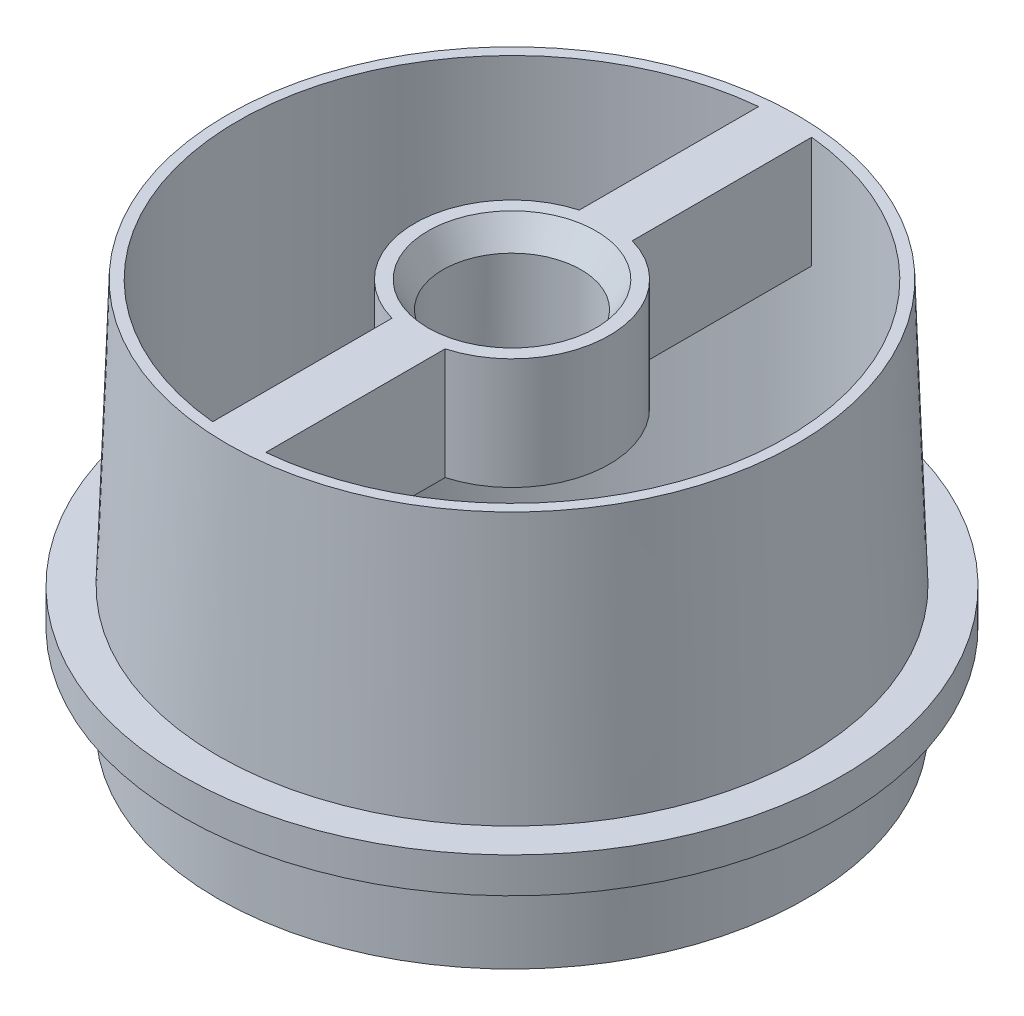
ISO-10303-21;
HEADER;
FILE_DESCRIPTION(('STEP AP214'),'2;1');
FILE_NAME('part.step','',(''),(''),'','','');
FILE_SCHEMA(('AUTOMOTIVE_DESIGN { 1 0 10303 214 1 1 1 1 }'));
ENDSEC;
DATA;
#1=APPLICATION_CONTEXT('core data for automotive mechanical design processes');
#2=APPLICATION_PROTOCOL_DEFINITION('international standard','automotive_design',2000,#1);
#3=PRODUCT_CONTEXT('',#1,'mechanical');
#4=PRODUCT('Part','Part','',(#3));
#5=PRODUCT_RELATED_PRODUCT_CATEGORY('part','',(#4));
#6=PRODUCT_DEFINITION_FORMATION('','',#4);
#7=PRODUCT_DEFINITION_CONTEXT('part definition',#1,'design');
#8=PRODUCT_DEFINITION('design','',#6,#7);
#9=PRODUCT_DEFINITION_SHAPE('','',#8);
#10=(LENGTH_UNIT() NAMED_UNIT(*) SI_UNIT(.MILLI.,.METRE.));
#11=(NAMED_UNIT(*) PLANE_ANGLE_UNIT() SI_UNIT($,.RADIAN.));
#12=(NAMED_UNIT(*) SI_UNIT($,.STERADIAN.) SOLID_ANGLE_UNIT());
#13=UNCERTAINTY_MEASURE_WITH_UNIT(LENGTH_MEASURE(1.E-05),#10,'distance_accuracy_value','');
#14=(GEOMETRIC_REPRESENTATION_CONTEXT(3) GLOBAL_UNCERTAINTY_ASSIGNED_CONTEXT((#13)) GLOBAL_UNIT_ASSIGNED_CONTEXT((#10,
#11,#12)) REPRESENTATION_CONTEXT('',''));
#15=CARTESIAN_POINT('',(0.,0.,0.));
#16=DIRECTION('',(0.,0.,1.));
#17=DIRECTION('',(1.,0.,0.));
#18=AXIS2_PLACEMENT_3D('',#15,#16,#17);
#19=CARTESIAN_POINT('',(0.,-2.,0.));
#20=DIRECTION('',(0.,1.,0.));
#21=DIRECTION('',(0.,0.,1.));
#22=AXIS2_PLACEMENT_3D('',#19,#20,#21);
#23=PLANE('',#22);
#24=CARTESIAN_POINT('',(0.,-2.,0.));
#25=DIRECTION('',(0.,1.,0.));
#26=DIRECTION('',(0.,0.,1.));
#27=AXIS2_PLACEMENT_3D('',#24,#25,#26);
#28=CIRCLE('',#27,18.625);
#29=CARTESIAN_POINT('',(0.,-2.,18.625));
#30=VERTEX_POINT('',#29);
#31=EDGE_CURVE('E178',#30,#30,#28,.T.);
#32=ORIENTED_EDGE('',*,*,#31,.F.);
#33=EDGE_LOOP('',(#32));
#34=FACE_BOUND('',#33,.T.);
#35=CARTESIAN_POINT('',(0.,-2.,0.));
#36=DIRECTION('',(0.,1.,0.));
#37=DIRECTION('',(0.,0.,1.));
#38=AXIS2_PLACEMENT_3D('',#35,#36,#37);
#39=CIRCLE('',#38,16.625);
#40=CARTESIAN_POINT('',(0.,-2.,16.625));
#41=VERTEX_POINT('',#40);
#42=EDGE_CURVE('E11',#41,#41,#39,.F.);
#43=ORIENTED_EDGE('',*,*,#42,.F.);
#44=EDGE_LOOP('',(#43));
#45=FACE_BOUND('',#44,.T.);
#46=ADVANCED_FACE('F33',(#34,#45),#23,.F.);
#47=CARTESIAN_POINT('',(0.,15.,0.));
#48=DIRECTION('',(0.,1.,0.));
#49=DIRECTION('',(0.,0.,1.));
#50=AXIS2_PLACEMENT_3D('',#47,#48,#49);
#51=PLANE('',#50);
#52=CARTESIAN_POINT('',(0.,15.,0.));
#53=DIRECTION('',(0.,1.,0.));
#54=DIRECTION('',(0.,0.,1.));
#55=AXIS2_PLACEMENT_3D('',#52,#53,#54);
#56=CIRCLE('',#55,4.75);
#57=CARTESIAN_POINT('',(0.,15.,4.75));
#58=VERTEX_POINT('',#57);
#59=EDGE_CURVE('E191',#58,#58,#56,.T.);
#60=ORIENTED_EDGE('',*,*,#59,.F.);
#61=EDGE_LOOP('',(#60));
#62=FACE_BOUND('',#61,.T.);
#63=CARTESIAN_POINT('',(0.,15.,0.));
#64=DIRECTION('',(0.,1.,0.));
#65=DIRECTION('',(0.,0.,1.));
#66=AXIS2_PLACEMENT_3D('',#63,#64,#65);
#67=CIRCLE('',#66,15.5);
#68=CARTESIAN_POINT('',(1.50911643518009,15.,15.4263595052452));
#69=VERTEX_POINT('',#68);
#70=CARTESIAN_POINT('',(1.50911643518009,15.,-15.4263595052452));
#71=VERTEX_POINT('',#70);
#72=EDGE_CURVE('E169',#69,#71,#67,.T.);
#73=ORIENTED_EDGE('',*,*,#72,.F.);
#74=DIRECTION('',(0.,0.,-1.));
#75=VECTOR('',#74,1.);
#76=CARTESIAN_POINT('',(1.50911643518009,15.,5.28890986736107));
#77=LINE('',#76,#75);
#78=CARTESIAN_POINT('',(1.50911643518009,15.,5.28890986736107));
#79=VERTEX_POINT('',#78);
#80=EDGE_CURVE('E148',#69,#79,#77,.T.);
#81=ORIENTED_EDGE('',*,*,#80,.T.);
#82=CARTESIAN_POINT('',(0.,15.,0.));
#83=DIRECTION('',(0.,1.,0.));
#84=DIRECTION('',(0.,0.,1.));
#85=AXIS2_PLACEMENT_3D('',#82,#83,#84);
#86=CIRCLE('',#85,5.5);
#87=CARTESIAN_POINT('',(1.5091164351801,15.,-5.28890986736107));
#88=VERTEX_POINT('',#87);
#89=EDGE_CURVE('E151',#79,#88,#86,.T.);
#90=ORIENTED_EDGE('',*,*,#89,.T.);
#91=DIRECTION('',(0.,0.,-1.));
#92=VECTOR('',#91,1.);
#93=CARTESIAN_POINT('',(1.50911643518009,15.,-15.4263595052452));
#94=LINE('',#93,#92);
#95=EDGE_CURVE('E126',#88,#71,#94,.T.);
#96=ORIENTED_EDGE('',*,*,#95,.T.);
#97=EDGE_LOOP('',(#73,#81,#90,#96));
#98=FACE_BOUND('',#97,.T.);
#99=CARTESIAN_POINT('',(0.,15.,0.));
#100=DIRECTION('',(0.,1.,0.));
#101=DIRECTION('',(0.,0.,1.));
#102=AXIS2_PLACEMENT_3D('',#99,#100,#101);
#103=CIRCLE('',#102,16.1011884576238);
#104=CARTESIAN_POINT('',(0.,15.,16.1011884576238));
#105=VERTEX_POINT('',#104);
#106=EDGE_CURVE('E42',#105,#105,#103,.T.);
#107=ORIENTED_EDGE('',*,*,#106,.T.);
#108=EDGE_LOOP('',(#107));
#109=FACE_BOUND('',#108,.T.);
#110=DIRECTION('',(0.,0.,1.));
#111=VECTOR('',#110,1.);
#112=CARTESIAN_POINT('',(-1.4908835648199,15.,5.29407840857593));
#113=LINE('',#112,#111);
#114=CARTESIAN_POINT('',(-1.49088356481991,15.,5.29407840857593));
#115=VERTEX_POINT('',#114);
#116=CARTESIAN_POINT('',(-1.49088356481991,15.,15.4281322977264));
#117=VERTEX_POINT('',#116);
#118=EDGE_CURVE('E145',#115,#117,#113,.T.);
#119=ORIENTED_EDGE('',*,*,#118,.T.);
#120=CARTESIAN_POINT('',(-1.49088356481991,15.,-15.4281322977264));
#121=VERTEX_POINT('',#120);
#122=EDGE_CURVE('E159',#121,#117,#67,.T.);
#123=ORIENTED_EDGE('',*,*,#122,.F.);
#124=DIRECTION('',(0.,0.,1.));
#125=VECTOR('',#124,1.);
#126=CARTESIAN_POINT('',(-1.4908835648199,15.,-5.29407840857593));
#127=LINE('',#126,#125);
#128=CARTESIAN_POINT('',(-1.4908835648199,15.,-5.29407840857593));
#129=VERTEX_POINT('',#128);
#130=EDGE_CURVE('E141',#121,#129,#127,.T.);
#131=ORIENTED_EDGE('',*,*,#130,.T.);
#132=CARTESIAN_POINT('',(0.,15.,0.));
#133=DIRECTION('',(0.,1.,0.));
#134=DIRECTION('',(0.,0.,1.));
#135=AXIS2_PLACEMENT_3D('',#132,#133,#134);
#136=CIRCLE('',#135,5.5);
#137=EDGE_CURVE('E104',#129,#115,#136,.T.);
#138=ORIENTED_EDGE('',*,*,#137,.T.);
#139=EDGE_LOOP('',(#119,#123,#131,#138));
#140=FACE_BOUND('',#139,.T.);
#141=ADVANCED_FACE('F200',(#62,#98,#109,#140),#51,.T.);
#142=CARTESIAN_POINT('',(0.,0.,0.));
#143=DIRECTION('',(0.,-1.,0.));
#144=DIRECTION('',(0.,0.,1.));
#145=AXIS2_PLACEMENT_3D('',#142,#143,#144);
#146=CONICAL_SURFACE('',#145,16.625,0.0349065850398866);
#147=ORIENTED_EDGE('',*,*,#106,.F.);
#148=EDGE_LOOP('',(#147));
#149=FACE_BOUND('',#148,.T.);
#150=CARTESIAN_POINT('',(0.,0.,0.));
#151=DIRECTION('',(0.,1.,0.));
#152=DIRECTION('',(0.,0.,1.));
#153=AXIS2_PLACEMENT_3D('',#150,#151,#152);
#154=CIRCLE('',#153,16.625);
#155=CARTESIAN_POINT('',(0.,0.,16.625));
#156=VERTEX_POINT('',#155);
#157=EDGE_CURVE('E181',#156,#156,#154,.T.);
#158=ORIENTED_EDGE('',*,*,#157,.T.);
#159=EDGE_LOOP('',(#158));
#160=FACE_BOUND('',#159,.T.);
#161=ADVANCED_FACE('F35',(#149,#160),#146,.T.);
#162=CARTESIAN_POINT('',(0.,-2.,0.));
#163=DIRECTION('',(0.,1.,0.));
#164=DIRECTION('',(0.,0.,1.));
#165=AXIS2_PLACEMENT_3D('',#162,#163,#164);
#166=CYLINDRICAL_SURFACE('',#165,18.625);
#167=ORIENTED_EDGE('',*,*,#31,.T.);
#168=EDGE_LOOP('',(#167));
#169=FACE_BOUND('',#168,.T.);
#170=CARTESIAN_POINT('',(0.,0.,0.));
#171=DIRECTION('',(0.,1.,0.));
#172=DIRECTION('',(0.,0.,1.));
#173=AXIS2_PLACEMENT_3D('',#170,#171,#172);
#174=CIRCLE('',#173,18.625);
#175=CARTESIAN_POINT('',(0.,0.,18.625));
#176=VERTEX_POINT('',#175);
#177=EDGE_CURVE('E177',#176,#176,#174,.T.);
#178=ORIENTED_EDGE('',*,*,#177,.F.);
#179=EDGE_LOOP('',(#178));
#180=FACE_BOUND('',#179,.T.);
#181=ADVANCED_FACE('F234',(#169,#180),#166,.T.);
#182=CARTESIAN_POINT('',(0.,0.,0.));
#183=DIRECTION('',(0.,1.,0.));
#184=DIRECTION('',(0.,0.,1.));
#185=AXIS2_PLACEMENT_3D('',#182,#183,#184);
#186=PLANE('',#185);
#187=ORIENTED_EDGE('',*,*,#157,.F.);
#188=EDGE_LOOP('',(#187));
#189=FACE_BOUND('',#188,.T.);
#190=ORIENTED_EDGE('',*,*,#177,.T.);
#191=EDGE_LOOP('',(#190));
#192=FACE_BOUND('',#191,.T.);
#193=ADVANCED_FACE('F231',(#189,#192),#186,.T.);
#194=CARTESIAN_POINT('',(0.,-2.,0.));
#195=DIRECTION('',(0.,1.,0.));
#196=DIRECTION('',(0.,0.,1.));
#197=AXIS2_PLACEMENT_3D('',#194,#195,#196);
#198=CYLINDRICAL_SURFACE('',#197,15.5);
#199=CARTESIAN_POINT('',(0.,8.7,0.));
#200=DIRECTION('',(0.,1.,0.));
#201=DIRECTION('',(0.,0.,1.));
#202=AXIS2_PLACEMENT_3D('',#199,#200,#201);
#203=CIRCLE('',#202,15.5);
#204=CARTESIAN_POINT('',(-1.49088356481991,8.7,15.4281322977264));
#205=VERTEX_POINT('',#204);
#206=CARTESIAN_POINT('',(1.50911643518009,8.7,15.4263595052452));
#207=VERTEX_POINT('',#206);
#208=EDGE_CURVE('E50',#205,#207,#203,.T.);
#209=ORIENTED_EDGE('',*,*,#208,.T.);
#210=DIRECTION('',(0.,1.,0.));
#211=VECTOR('',#210,1.);
#212=CARTESIAN_POINT('',(1.50911643518009,8.7,15.4263595052452));
#213=LINE('',#212,#211);
#214=EDGE_CURVE('E164',#207,#69,#213,.T.);
#215=ORIENTED_EDGE('',*,*,#214,.T.);
#216=ORIENTED_EDGE('',*,*,#72,.T.);
#217=DIRECTION('',(0.,1.,0.));
#218=VECTOR('',#217,1.);
#219=CARTESIAN_POINT('',(1.50911643518009,8.7,-15.4263595052452));
#220=LINE('',#219,#218);
#221=CARTESIAN_POINT('',(1.50911643518009,8.7,-15.4263595052452));
#222=VERTEX_POINT('',#221);
#223=EDGE_CURVE('E156',#222,#71,#220,.T.);
#224=ORIENTED_EDGE('',*,*,#223,.F.);
#225=CARTESIAN_POINT('',(0.,8.7,0.));
#226=DIRECTION('',(0.,1.,0.));
#227=DIRECTION('',(0.,0.,-1.));
#228=AXIS2_PLACEMENT_3D('',#225,#226,#227);
#229=CIRCLE('',#228,15.5);
#230=CARTESIAN_POINT('',(-1.49088356481991,8.7,-15.4281322977264));
#231=VERTEX_POINT('',#230);
#232=EDGE_CURVE('E124',#222,#231,#229,.T.);
#233=ORIENTED_EDGE('',*,*,#232,.T.);
#234=DIRECTION('',(0.,1.,0.));
#235=VECTOR('',#234,1.);
#236=CARTESIAN_POINT('',(-1.49088356481991,8.7,-15.4281322977264));
#237=LINE('',#236,#235);
#238=EDGE_CURVE('E110',#231,#121,#237,.T.);
#239=ORIENTED_EDGE('',*,*,#238,.T.);
#240=ORIENTED_EDGE('',*,*,#122,.T.);
#241=DIRECTION('',(0.,1.,0.));
#242=VECTOR('',#241,1.);
#243=CARTESIAN_POINT('',(-1.49088356481991,8.7,15.4281322977264));
#244=LINE('',#243,#242);
#245=EDGE_CURVE('E55',#205,#117,#244,.T.);
#246=ORIENTED_EDGE('',*,*,#245,.F.);
#247=EDGE_LOOP('',(#209,#215,#216,#224,#233,#239,#240,#246));
#248=FACE_BOUND('',#247,.T.);
#249=CARTESIAN_POINT('',(0.,-7.,0.));
#250=DIRECTION('',(0.,-1.,0.));
#251=DIRECTION('',(0.,0.,-1.));
#252=AXIS2_PLACEMENT_3D('',#249,#250,#251);
#253=CIRCLE('',#252,15.5);
#254=CARTESIAN_POINT('',(0.,-7.,-15.5));
#255=VERTEX_POINT('',#254);
#256=EDGE_CURVE('E171',#255,#255,#253,.T.);
#257=ORIENTED_EDGE('',*,*,#256,.T.);
#258=EDGE_LOOP('',(#257));
#259=FACE_BOUND('',#258,.T.);
#260=ADVANCED_FACE('F229',(#248,#259),#198,.F.);
#261=CARTESIAN_POINT('',(0.,-7.,0.));
#262=DIRECTION('',(0.,-1.,0.));
#263=DIRECTION('',(0.,0.,-1.));
#264=AXIS2_PLACEMENT_3D('',#261,#262,#263);
#265=PLANE('',#264);
#266=CARTESIAN_POINT('',(0.,-7.,0.));
#267=DIRECTION('',(0.,-1.,0.));
#268=DIRECTION('',(0.,0.,-1.));
#269=AXIS2_PLACEMENT_3D('',#266,#267,#268);
#270=CIRCLE('',#269,16.625);
#271=CARTESIAN_POINT('',(0.,-7.,-16.625));
#272=VERTEX_POINT('',#271);
#273=EDGE_CURVE('E174',#272,#272,#270,.T.);
#274=ORIENTED_EDGE('',*,*,#273,.T.);
#275=EDGE_LOOP('',(#274));
#276=FACE_BOUND('',#275,.T.);
#277=ORIENTED_EDGE('',*,*,#256,.F.);
#278=EDGE_LOOP('',(#277));
#279=FACE_BOUND('',#278,.T.);
#280=ADVANCED_FACE('F302',(#276,#279),#265,.T.);
#281=CARTESIAN_POINT('',(0.,-7.,0.));
#282=DIRECTION('',(0.,1.,0.));
#283=DIRECTION('',(0.,0.,1.));
#284=AXIS2_PLACEMENT_3D('',#281,#282,#283);
#285=CYLINDRICAL_SURFACE('',#284,16.625);
#286=ORIENTED_EDGE('',*,*,#273,.F.);
#287=EDGE_LOOP('',(#286));
#288=FACE_BOUND('',#287,.T.);
#289=ORIENTED_EDGE('',*,*,#42,.T.);
#290=EDGE_LOOP('',(#289));
#291=FACE_BOUND('',#290,.T.);
#292=ADVANCED_FACE('F288',(#288,#291),#285,.T.);
#293=CARTESIAN_POINT('',(1.50911643518009,8.7,-15.4263595052452));
#294=DIRECTION('',(1.,0.,0.));
#295=DIRECTION('',(0.,0.,-1.));
#296=AXIS2_PLACEMENT_3D('',#293,#294,#295);
#297=PLANE('',#296);
#298=ORIENTED_EDGE('',*,*,#95,.F.);
#299=DIRECTION('',(0.,1.,0.));
#300=VECTOR('',#299,1.);
#301=CARTESIAN_POINT('',(1.5091164351801,8.7,-5.28890986736107));
#302=LINE('',#301,#300);
#303=CARTESIAN_POINT('',(1.5091164351801,8.7,-5.28890986736107));
#304=VERTEX_POINT('',#303);
#305=EDGE_CURVE('E160',#304,#88,#302,.T.);
#306=ORIENTED_EDGE('',*,*,#305,.F.);
#307=DIRECTION('',(0.,0.,-1.));
#308=VECTOR('',#307,1.);
#309=CARTESIAN_POINT('',(1.50911643518009,8.7,-15.4263595052452));
#310=LINE('',#309,#308);
#311=EDGE_CURVE('E138',#304,#222,#310,.T.);
#312=ORIENTED_EDGE('',*,*,#311,.T.);
#313=ORIENTED_EDGE('',*,*,#223,.T.);
#314=EDGE_LOOP('',(#298,#306,#312,#313));
#315=FACE_BOUND('',#314,.T.);
#316=ADVANCED_FACE('F285',(#315),#297,.T.);
#317=CARTESIAN_POINT('',(0.,8.7,0.));
#318=DIRECTION('',(0.,1.,0.));
#319=DIRECTION('',(0.,0.,1.));
#320=AXIS2_PLACEMENT_3D('',#317,#318,#319);
#321=CYLINDRICAL_SURFACE('',#320,5.5);
#322=ORIENTED_EDGE('',*,*,#89,.F.);
#323=DIRECTION('',(0.,1.,0.));
#324=VECTOR('',#323,1.);
#325=CARTESIAN_POINT('',(1.50911643518009,8.7,5.28890986736107));
#326=LINE('',#325,#324);
#327=CARTESIAN_POINT('',(1.50911643518009,8.7,5.28890986736107));
#328=VERTEX_POINT('',#327);
#329=EDGE_CURVE('E162',#328,#79,#326,.T.);
#330=ORIENTED_EDGE('',*,*,#329,.F.);
#331=CARTESIAN_POINT('',(0.,8.7,0.));
#332=DIRECTION('',(0.,1.,0.));
#333=DIRECTION('',(0.,0.,1.));
#334=AXIS2_PLACEMENT_3D('',#331,#332,#333);
#335=CIRCLE('',#334,5.5);
#336=EDGE_CURVE('E135',#328,#304,#335,.T.);
#337=ORIENTED_EDGE('',*,*,#336,.T.);
#338=ORIENTED_EDGE('',*,*,#305,.T.);
#339=EDGE_LOOP('',(#322,#330,#337,#338));
#340=FACE_BOUND('',#339,.T.);
#341=ADVANCED_FACE('F217',(#340),#321,.T.);
#342=CARTESIAN_POINT('',(1.50911643518009,8.7,5.28890986736107));
#343=DIRECTION('',(1.,0.,0.));
#344=DIRECTION('',(0.,0.,-1.));
#345=AXIS2_PLACEMENT_3D('',#342,#343,#344);
#346=PLANE('',#345);
#347=ORIENTED_EDGE('',*,*,#80,.F.);
#348=ORIENTED_EDGE('',*,*,#214,.F.);
#349=DIRECTION('',(0.,0.,-1.));
#350=VECTOR('',#349,1.);
#351=CARTESIAN_POINT('',(1.50911643518009,8.7,5.28890986736107));
#352=LINE('',#351,#350);
#353=EDGE_CURVE('E132',#207,#328,#352,.T.);
#354=ORIENTED_EDGE('',*,*,#353,.T.);
#355=ORIENTED_EDGE('',*,*,#329,.T.);
#356=EDGE_LOOP('',(#347,#348,#354,#355));
#357=FACE_BOUND('',#356,.T.);
#358=ADVANCED_FACE('F210',(#357),#346,.T.);
#359=CARTESIAN_POINT('',(-1.4908835648199,8.7,5.29407840857593));
#360=DIRECTION('',(-1.,0.,0.));
#361=DIRECTION('',(0.,0.,1.));
#362=AXIS2_PLACEMENT_3D('',#359,#360,#361);
#363=PLANE('',#362);
#364=ORIENTED_EDGE('',*,*,#118,.F.);
#365=DIRECTION('',(0.,1.,0.));
#366=VECTOR('',#365,1.);
#367=CARTESIAN_POINT('',(-1.49088356481991,8.7,5.29407840857593));
#368=LINE('',#367,#366);
#369=CARTESIAN_POINT('',(-1.49088356481991,8.7,5.29407840857593));
#370=VERTEX_POINT('',#369);
#371=EDGE_CURVE('E109',#370,#115,#368,.T.);
#372=ORIENTED_EDGE('',*,*,#371,.F.);
#373=DIRECTION('',(0.,0.,1.));
#374=VECTOR('',#373,1.);
#375=CARTESIAN_POINT('',(-1.4908835648199,8.7,5.29407840857593));
#376=LINE('',#375,#374);
#377=EDGE_CURVE('E119',#370,#205,#376,.T.);
#378=ORIENTED_EDGE('',*,*,#377,.T.);
#379=ORIENTED_EDGE('',*,*,#245,.T.);
#380=EDGE_LOOP('',(#364,#372,#378,#379));
#381=FACE_BOUND('',#380,.T.);
#382=ADVANCED_FACE('F208',(#381),#363,.T.);
#383=CARTESIAN_POINT('',(0.,8.7,0.));
#384=DIRECTION('',(0.,1.,0.));
#385=DIRECTION('',(0.,0.,1.));
#386=AXIS2_PLACEMENT_3D('',#383,#384,#385);
#387=CYLINDRICAL_SURFACE('',#386,5.5);
#388=ORIENTED_EDGE('',*,*,#137,.F.);
#389=DIRECTION('',(0.,1.,0.));
#390=VECTOR('',#389,1.);
#391=CARTESIAN_POINT('',(-1.4908835648199,8.7,-5.29407840857593));
#392=LINE('',#391,#390);
#393=CARTESIAN_POINT('',(-1.4908835648199,8.7,-5.29407840857593));
#394=VERTEX_POINT('',#393);
#395=EDGE_CURVE('E99',#394,#129,#392,.T.);
#396=ORIENTED_EDGE('',*,*,#395,.F.);
#397=CARTESIAN_POINT('',(0.,8.7,0.));
#398=DIRECTION('',(0.,1.,0.));
#399=DIRECTION('',(0.,0.,1.));
#400=AXIS2_PLACEMENT_3D('',#397,#398,#399);
#401=CIRCLE('',#400,5.5);
#402=EDGE_CURVE('E102',#394,#370,#401,.T.);
#403=ORIENTED_EDGE('',*,*,#402,.T.);
#404=ORIENTED_EDGE('',*,*,#371,.T.);
#405=EDGE_LOOP('',(#388,#396,#403,#404));
#406=FACE_BOUND('',#405,.T.);
#407=ADVANCED_FACE('F101',(#406),#387,.T.);
#408=CARTESIAN_POINT('',(-1.4908835648199,8.7,-5.29407840857593));
#409=DIRECTION('',(-1.,0.,0.));
#410=DIRECTION('',(0.,0.,1.));
#411=AXIS2_PLACEMENT_3D('',#408,#409,#410);
#412=PLANE('',#411);
#413=ORIENTED_EDGE('',*,*,#130,.F.);
#414=ORIENTED_EDGE('',*,*,#238,.F.);
#415=DIRECTION('',(0.,0.,1.));
#416=VECTOR('',#415,1.);
#417=CARTESIAN_POINT('',(-1.4908835648199,8.7,-5.29407840857593));
#418=LINE('',#417,#416);
#419=EDGE_CURVE('E117',#231,#394,#418,.T.);
#420=ORIENTED_EDGE('',*,*,#419,.T.);
#421=ORIENTED_EDGE('',*,*,#395,.T.);
#422=EDGE_LOOP('',(#413,#414,#420,#421));
#423=FACE_BOUND('',#422,.T.);
#424=ADVANCED_FACE('F122',(#423),#412,.T.);
#425=CARTESIAN_POINT('',(0.,8.7,0.));
#426=DIRECTION('',(0.,-1.,0.));
#427=DIRECTION('',(0.,0.,-1.));
#428=AXIS2_PLACEMENT_3D('',#425,#426,#427);
#429=PLANE('',#428);
#430=CARTESIAN_POINT('',(0.,8.7,0.));
#431=DIRECTION('',(0.,-1.,0.));
#432=DIRECTION('',(0.,0.,-1.));
#433=AXIS2_PLACEMENT_3D('',#430,#431,#432);
#434=CIRCLE('',#433,3.9);
#435=CARTESIAN_POINT('',(0.,8.7,-3.9));
#436=VERTEX_POINT('',#435);
#437=EDGE_CURVE('E143',#436,#436,#434,.T.);
#438=ORIENTED_EDGE('',*,*,#437,.F.);
#439=EDGE_LOOP('',(#438));
#440=FACE_BOUND('',#439,.T.);
#441=ORIENTED_EDGE('',*,*,#232,.F.);
#442=ORIENTED_EDGE('',*,*,#311,.F.);
#443=ORIENTED_EDGE('',*,*,#336,.F.);
#444=ORIENTED_EDGE('',*,*,#353,.F.);
#445=ORIENTED_EDGE('',*,*,#208,.F.);
#446=ORIENTED_EDGE('',*,*,#377,.F.);
#447=ORIENTED_EDGE('',*,*,#402,.F.);
#448=ORIENTED_EDGE('',*,*,#419,.F.);
#449=EDGE_LOOP('',(#441,#442,#443,#444,#445,#446,#447,#448));
#450=FACE_BOUND('',#449,.T.);
#451=ADVANCED_FACE('F116',(#440,#450),#429,.T.);
#452=CARTESIAN_POINT('',(0.,-7.,0.));
#453=DIRECTION('',(0.,1.,0.));
#454=DIRECTION('',(0.,0.,1.));
#455=AXIS2_PLACEMENT_3D('',#452,#453,#454);
#456=CYLINDRICAL_SURFACE('',#455,3.9);
#457=CARTESIAN_POINT('',(0.,13.5277568135665,0.));
#458=DIRECTION('',(0.,1.,0.));
#459=DIRECTION('',(0.,0.,1.));
#460=AXIS2_PLACEMENT_3D('',#457,#458,#459);
#461=CIRCLE('',#460,3.9);
#462=CARTESIAN_POINT('',(0.,13.5277568135665,3.9));
#463=VERTEX_POINT('',#462);
#464=EDGE_CURVE('E37',#463,#463,#461,.T.);
#465=ORIENTED_EDGE('',*,*,#464,.T.);
#466=EDGE_LOOP('',(#465));
#467=FACE_BOUND('',#466,.T.);
#468=ORIENTED_EDGE('',*,*,#437,.T.);
#469=EDGE_LOOP('',(#468));
#470=FACE_BOUND('',#469,.T.);
#471=ADVANCED_FACE('F266',(#467,#470),#456,.F.);
#472=CARTESIAN_POINT('',(0.,15.,0.));
#473=DIRECTION('',(0.,1.,0.));
#474=DIRECTION('',(0.,0.,1.));
#475=AXIS2_PLACEMENT_3D('',#472,#473,#474);
#476=CONICAL_SURFACE('',#475,4.75,0.5235987755983);
#477=ORIENTED_EDGE('',*,*,#59,.T.);
#478=EDGE_LOOP('',(#477));
#479=FACE_BOUND('',#478,.T.);
#480=ORIENTED_EDGE('',*,*,#464,.F.);
#481=EDGE_LOOP('',(#480));
#482=FACE_BOUND('',#481,.T.);
#483=ADVANCED_FACE('F197',(#479,#482),#476,.F.);
#484=CLOSED_SHELL('',(#46,#141,#161,#181,#193,#260,#280,#292,#316,#341,#358,#382,#407,#424,#451,
#471,#483));
#485=MANIFOLD_SOLID_BREP('B2',#484);
#486=ADVANCED_BREP_SHAPE_REPRESENTATION('',(#18,#485),#14);
#487=SHAPE_DEFINITION_REPRESENTATION(#9,#486);
ENDSEC;
END-ISO-10303-21;
